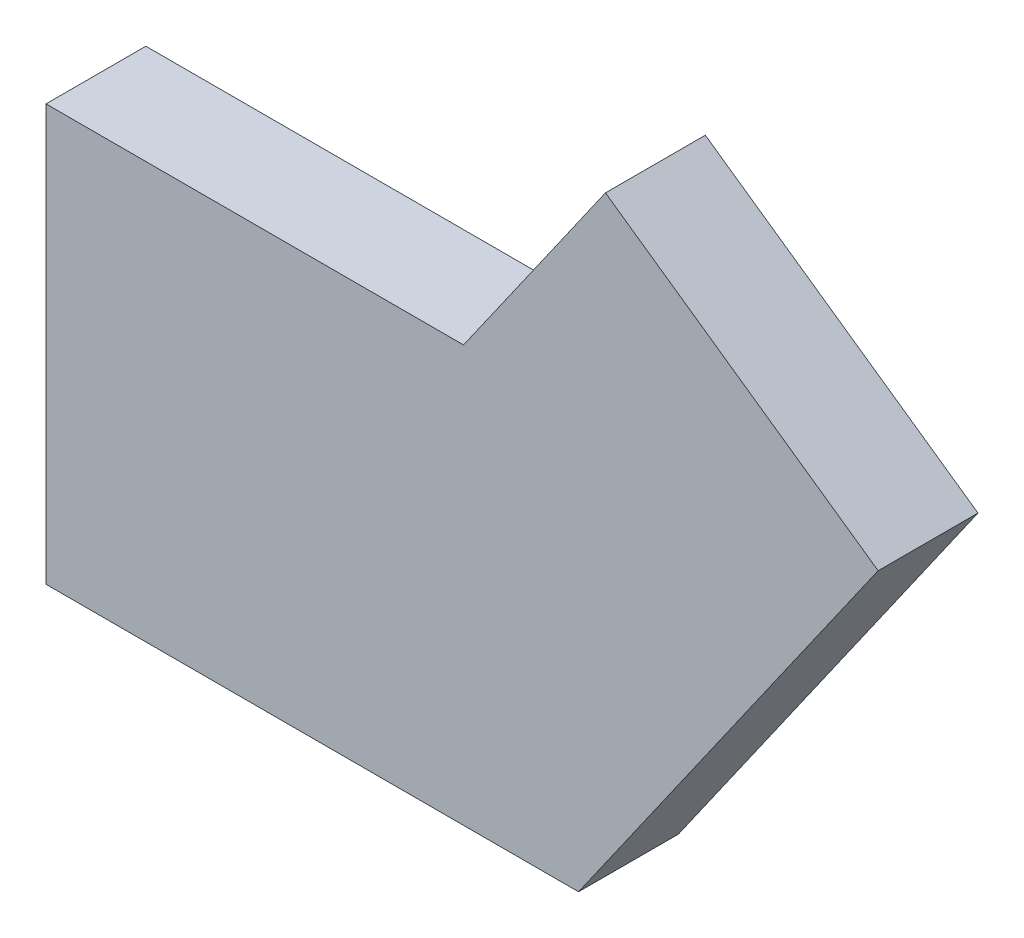
ISO-10303-21;
HEADER;
FILE_DESCRIPTION(('STEP AP214'),'2;1');
FILE_NAME('part.step','',(''),(''),'','','');
FILE_SCHEMA(('AUTOMOTIVE_DESIGN { 1 0 10303 214 1 1 1 1 }'));
ENDSEC;
DATA;
#1=APPLICATION_CONTEXT('core data for automotive mechanical design processes');
#2=APPLICATION_PROTOCOL_DEFINITION('international standard','automotive_design',2000,#1);
#3=PRODUCT_CONTEXT('',#1,'mechanical');
#4=PRODUCT('Part','Part','',(#3));
#5=PRODUCT_RELATED_PRODUCT_CATEGORY('part','',(#4));
#6=PRODUCT_DEFINITION_FORMATION('','',#4);
#7=PRODUCT_DEFINITION_CONTEXT('part definition',#1,'design');
#8=PRODUCT_DEFINITION('design','',#6,#7);
#9=PRODUCT_DEFINITION_SHAPE('','',#8);
#10=(LENGTH_UNIT() NAMED_UNIT(*) SI_UNIT(.MILLI.,.METRE.));
#11=(NAMED_UNIT(*) PLANE_ANGLE_UNIT() SI_UNIT($,.RADIAN.));
#12=(NAMED_UNIT(*) SI_UNIT($,.STERADIAN.) SOLID_ANGLE_UNIT());
#13=UNCERTAINTY_MEASURE_WITH_UNIT(LENGTH_MEASURE(1.E-05),#10,'distance_accuracy_value','');
#14=(GEOMETRIC_REPRESENTATION_CONTEXT(3) GLOBAL_UNCERTAINTY_ASSIGNED_CONTEXT((#13)) GLOBAL_UNIT_ASSIGNED_CONTEXT((#10,
#11,#12)) REPRESENTATION_CONTEXT('',''));
#15=CARTESIAN_POINT('',(0.,0.,0.));
#16=DIRECTION('',(0.,0.,1.));
#17=DIRECTION('',(1.,0.,0.));
#18=AXIS2_PLACEMENT_3D('',#15,#16,#17);
#19=CARTESIAN_POINT('',(-32.,25.,3.));
#20=DIRECTION('',(1.,0.,0.));
#21=DIRECTION('',(0.,0.,-1.));
#22=AXIS2_PLACEMENT_3D('',#19,#20,#21);
#23=PLANE('',#22);
#24=DIRECTION('',(0.,-1.,0.));
#25=VECTOR('',#24,1.);
#26=CARTESIAN_POINT('',(-32.,25.,-3.));
#27=LINE('',#26,#25);
#28=CARTESIAN_POINT('',(-32.,25.,-3.));
#29=VERTEX_POINT('',#28);
#30=CARTESIAN_POINT('',(-32.,0.,-3.));
#31=VERTEX_POINT('',#30);
#32=EDGE_CURVE('E119',#29,#31,#27,.T.);
#33=ORIENTED_EDGE('',*,*,#32,.T.);
#34=DIRECTION('',(0.,0.,-1.));
#35=VECTOR('',#34,1.);
#36=CARTESIAN_POINT('',(-32.,0.,3.));
#37=LINE('',#36,#35);
#38=CARTESIAN_POINT('',(-32.,0.,3.));
#39=VERTEX_POINT('',#38);
#40=EDGE_CURVE('E11',#39,#31,#37,.T.);
#41=ORIENTED_EDGE('',*,*,#40,.F.);
#42=DIRECTION('',(0.,-1.,0.));
#43=VECTOR('',#42,1.);
#44=CARTESIAN_POINT('',(-32.,25.,3.));
#45=LINE('',#44,#43);
#46=CARTESIAN_POINT('',(-32.,25.,3.));
#47=VERTEX_POINT('',#46);
#48=EDGE_CURVE('E129',#47,#39,#45,.T.);
#49=ORIENTED_EDGE('',*,*,#48,.F.);
#50=DIRECTION('',(0.,0.,-1.));
#51=VECTOR('',#50,1.);
#52=CARTESIAN_POINT('',(-32.,25.,3.));
#53=LINE('',#52,#51);
#54=EDGE_CURVE('E115',#47,#29,#53,.T.);
#55=ORIENTED_EDGE('',*,*,#54,.T.);
#56=EDGE_LOOP('',(#33,#41,#49,#55));
#57=FACE_BOUND('',#56,.T.);
#58=ADVANCED_FACE('F35',(#57),#23,.F.);
#59=CARTESIAN_POINT('',(-32.,0.,3.));
#60=DIRECTION('',(0.,1.,0.));
#61=DIRECTION('',(0.,0.,1.));
#62=AXIS2_PLACEMENT_3D('',#59,#60,#61);
#63=PLANE('',#62);
#64=DIRECTION('',(1.,0.,0.));
#65=VECTOR('',#64,1.);
#66=CARTESIAN_POINT('',(-32.,0.,-3.));
#67=LINE('',#66,#65);
#68=CARTESIAN_POINT('',(0.,0.,-3.));
#69=VERTEX_POINT('',#68);
#70=EDGE_CURVE('E122',#31,#69,#67,.T.);
#71=ORIENTED_EDGE('',*,*,#70,.T.);
#72=DIRECTION('',(0.,0.,-1.));
#73=VECTOR('',#72,1.);
#74=CARTESIAN_POINT('',(0.,0.,3.));
#75=LINE('',#74,#73);
#76=CARTESIAN_POINT('',(0.,0.,3.));
#77=VERTEX_POINT('',#76);
#78=EDGE_CURVE('E43',#77,#69,#75,.T.);
#79=ORIENTED_EDGE('',*,*,#78,.F.);
#80=DIRECTION('',(1.,0.,0.));
#81=VECTOR('',#80,1.);
#82=CARTESIAN_POINT('',(-32.,0.,3.));
#83=LINE('',#82,#81);
#84=EDGE_CURVE('E88',#39,#77,#83,.T.);
#85=ORIENTED_EDGE('',*,*,#84,.F.);
#86=ORIENTED_EDGE('',*,*,#40,.T.);
#87=EDGE_LOOP('',(#71,#79,#85,#86));
#88=FACE_BOUND('',#87,.T.);
#89=ADVANCED_FACE('F153',(#88),#63,.F.);
#90=CARTESIAN_POINT('',(0.,0.,3.));
#91=DIRECTION('',(-0.819152044288988,0.573576436351051,0.));
#92=DIRECTION('',(-0.573576436351051,-0.819152044288988,0.));
#93=AXIS2_PLACEMENT_3D('',#90,#91,#92);
#94=PLANE('',#93);
#95=DIRECTION('',(0.573576436351051,0.819152044288988,0.));
#96=VECTOR('',#95,1.);
#97=CARTESIAN_POINT('',(0.,0.,-3.));
#98=LINE('',#97,#96);
#99=CARTESIAN_POINT('',(18.,25.7066641213577,-3.));
#100=VERTEX_POINT('',#99);
#101=EDGE_CURVE('E124',#69,#100,#98,.T.);
#102=ORIENTED_EDGE('',*,*,#101,.T.);
#103=DIRECTION('',(0.,0.,-1.));
#104=VECTOR('',#103,1.);
#105=CARTESIAN_POINT('',(18.,25.7066641213577,3.));
#106=LINE('',#105,#104);
#107=CARTESIAN_POINT('',(18.,25.7066641213577,3.));
#108=VERTEX_POINT('',#107);
#109=EDGE_CURVE('E110',#108,#100,#106,.T.);
#110=ORIENTED_EDGE('',*,*,#109,.F.);
#111=DIRECTION('',(0.573576436351051,0.819152044288988,0.));
#112=VECTOR('',#111,1.);
#113=CARTESIAN_POINT('',(0.,0.,3.));
#114=LINE('',#113,#112);
#115=EDGE_CURVE('E101',#77,#108,#114,.T.);
#116=ORIENTED_EDGE('',*,*,#115,.F.);
#117=ORIENTED_EDGE('',*,*,#78,.T.);
#118=EDGE_LOOP('',(#102,#110,#116,#117));
#119=FACE_BOUND('',#118,.T.);
#120=ADVANCED_FACE('F135',(#119),#94,.F.);
#121=CARTESIAN_POINT('',(18.,25.7066641213577,3.));
#122=DIRECTION('',(-0.57357643635105,-0.819152044288989,0.));
#123=DIRECTION('',(0.819152044288989,-0.573576436351051,0.));
#124=AXIS2_PLACEMENT_3D('',#121,#122,#123);
#125=PLANE('',#124);
#126=DIRECTION('',(-0.819152044288989,0.57357643635105,0.));
#127=VECTOR('',#126,1.);
#128=CARTESIAN_POINT('',(18.,25.7066641213577,-3.));
#129=LINE('',#128,#127);
#130=CARTESIAN_POINT('',(1.61695911422023,37.1781928483787,-3.));
#131=VERTEX_POINT('',#130);
#132=EDGE_CURVE('E109',#100,#131,#129,.T.);
#133=ORIENTED_EDGE('',*,*,#132,.T.);
#134=DIRECTION('',(0.,0.,-1.));
#135=VECTOR('',#134,1.);
#136=CARTESIAN_POINT('',(1.61695911422023,37.1781928483787,3.));
#137=LINE('',#136,#135);
#138=CARTESIAN_POINT('',(1.61695911422023,37.1781928483787,3.));
#139=VERTEX_POINT('',#138);
#140=EDGE_CURVE('E106',#139,#131,#137,.T.);
#141=ORIENTED_EDGE('',*,*,#140,.F.);
#142=DIRECTION('',(-0.819152044288989,0.57357643635105,0.));
#143=VECTOR('',#142,1.);
#144=CARTESIAN_POINT('',(18.,25.7066641213577,3.));
#145=LINE('',#144,#143);
#146=EDGE_CURVE('E95',#108,#139,#145,.T.);
#147=ORIENTED_EDGE('',*,*,#146,.F.);
#148=ORIENTED_EDGE('',*,*,#109,.T.);
#149=EDGE_LOOP('',(#133,#141,#147,#148));
#150=FACE_BOUND('',#149,.T.);
#151=ADVANCED_FACE('F107',(#150),#125,.F.);
#152=CARTESIAN_POINT('',(1.61695911422023,37.1781928483787,3.));
#153=DIRECTION('',(0.819152044288988,-0.573576436351051,0.));
#154=DIRECTION('',(0.573576436351051,0.819152044288988,0.));
#155=AXIS2_PLACEMENT_3D('',#152,#153,#154);
#156=PLANE('',#155);
#157=DIRECTION('',(-0.573576436351051,-0.819152044288988,0.));
#158=VECTOR('',#157,1.);
#159=CARTESIAN_POINT('',(1.61695911422023,37.1781928483787,-3.));
#160=LINE('',#159,#158);
#161=CARTESIAN_POINT('',(-6.91030331998624,25.,-3.));
#162=VERTEX_POINT('',#161);
#163=EDGE_CURVE('E74',#131,#162,#160,.T.);
#164=ORIENTED_EDGE('',*,*,#163,.T.);
#165=DIRECTION('',(0.,0.,-1.));
#166=VECTOR('',#165,1.);
#167=CARTESIAN_POINT('',(-6.91030331998624,25.,3.));
#168=LINE('',#167,#166);
#169=CARTESIAN_POINT('',(-6.91030331998624,25.,3.));
#170=VERTEX_POINT('',#169);
#171=EDGE_CURVE('E111',#170,#162,#168,.T.);
#172=ORIENTED_EDGE('',*,*,#171,.F.);
#173=DIRECTION('',(-0.573576436351051,-0.819152044288988,0.));
#174=VECTOR('',#173,1.);
#175=CARTESIAN_POINT('',(1.61695911422023,37.1781928483787,3.));
#176=LINE('',#175,#174);
#177=EDGE_CURVE('E99',#139,#170,#176,.T.);
#178=ORIENTED_EDGE('',*,*,#177,.F.);
#179=ORIENTED_EDGE('',*,*,#140,.T.);
#180=EDGE_LOOP('',(#164,#172,#178,#179));
#181=FACE_BOUND('',#180,.T.);
#182=ADVANCED_FACE('F113',(#181),#156,.F.);
#183=CARTESIAN_POINT('',(-6.91030331998624,25.,3.));
#184=DIRECTION('',(0.,-1.,0.));
#185=DIRECTION('',(1.,0.,0.));
#186=AXIS2_PLACEMENT_3D('',#183,#184,#185);
#187=PLANE('',#186);
#188=DIRECTION('',(-1.,0.,0.));
#189=VECTOR('',#188,1.);
#190=CARTESIAN_POINT('',(-6.91030331998624,25.,-3.));
#191=LINE('',#190,#189);
#192=EDGE_CURVE('E80',#162,#29,#191,.T.);
#193=ORIENTED_EDGE('',*,*,#192,.T.);
#194=ORIENTED_EDGE('',*,*,#54,.F.);
#195=DIRECTION('',(-1.,0.,0.));
#196=VECTOR('',#195,1.);
#197=CARTESIAN_POINT('',(-6.91030331998624,25.,3.));
#198=LINE('',#197,#196);
#199=EDGE_CURVE('E51',#170,#47,#198,.T.);
#200=ORIENTED_EDGE('',*,*,#199,.F.);
#201=ORIENTED_EDGE('',*,*,#171,.T.);
#202=EDGE_LOOP('',(#193,#194,#200,#201));
#203=FACE_BOUND('',#202,.T.);
#204=ADVANCED_FACE('F142',(#203),#187,.F.);
#205=CARTESIAN_POINT('',(0.,0.,3.));
#206=DIRECTION('',(0.,0.,1.));
#207=DIRECTION('',(1.,0.,0.));
#208=AXIS2_PLACEMENT_3D('',#205,#206,#207);
#209=PLANE('',#208);
#210=ORIENTED_EDGE('',*,*,#48,.T.);
#211=ORIENTED_EDGE('',*,*,#84,.T.);
#212=ORIENTED_EDGE('',*,*,#115,.T.);
#213=ORIENTED_EDGE('',*,*,#146,.T.);
#214=ORIENTED_EDGE('',*,*,#177,.T.);
#215=ORIENTED_EDGE('',*,*,#199,.T.);
#216=EDGE_LOOP('',(#210,#211,#212,#213,#214,#215));
#217=FACE_BOUND('',#216,.T.);
#218=ADVANCED_FACE('F97',(#217),#209,.T.);
#219=CARTESIAN_POINT('',(0.,0.,-3.));
#220=DIRECTION('',(0.,0.,1.));
#221=DIRECTION('',(1.,0.,0.));
#222=AXIS2_PLACEMENT_3D('',#219,#220,#221);
#223=PLANE('',#222);
#224=ORIENTED_EDGE('',*,*,#32,.F.);
#225=ORIENTED_EDGE('',*,*,#192,.F.);
#226=ORIENTED_EDGE('',*,*,#163,.F.);
#227=ORIENTED_EDGE('',*,*,#132,.F.);
#228=ORIENTED_EDGE('',*,*,#101,.F.);
#229=ORIENTED_EDGE('',*,*,#70,.F.);
#230=EDGE_LOOP('',(#224,#225,#226,#227,#228,#229));
#231=FACE_BOUND('',#230,.T.);
#232=ADVANCED_FACE('F138',(#231),#223,.F.);
#233=CLOSED_SHELL('',(#58,#89,#120,#151,#182,#204,#218,#232));
#234=MANIFOLD_SOLID_BREP('B2',#233);
#235=ADVANCED_BREP_SHAPE_REPRESENTATION('',(#18,#234),#14);
#236=SHAPE_DEFINITION_REPRESENTATION(#9,#235);
ENDSEC;
END-ISO-10303-21;
